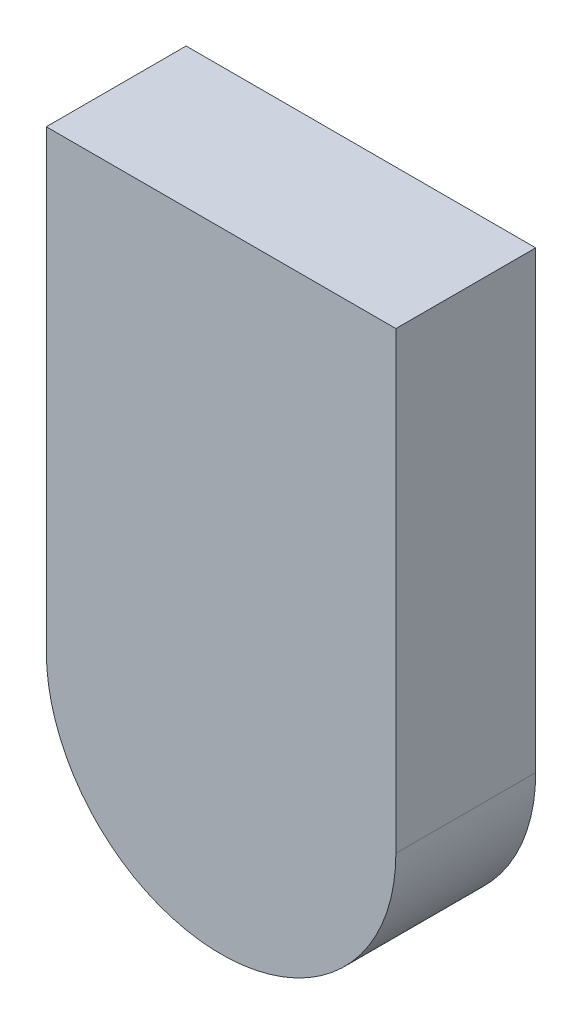
ISO-10303-21;
HEADER;
FILE_DESCRIPTION(('STEP AP214'),'2;1');
FILE_NAME('part.step','',(''),(''),'','','');
FILE_SCHEMA(('AUTOMOTIVE_DESIGN { 1 0 10303 214 1 1 1 1 }'));
ENDSEC;
DATA;
#1=APPLICATION_CONTEXT('core data for automotive mechanical design processes');
#2=APPLICATION_PROTOCOL_DEFINITION('international standard','automotive_design',2000,#1);
#3=PRODUCT_CONTEXT('',#1,'mechanical');
#4=PRODUCT('Part','Part','',(#3));
#5=PRODUCT_RELATED_PRODUCT_CATEGORY('part','',(#4));
#6=PRODUCT_DEFINITION_FORMATION('','',#4);
#7=PRODUCT_DEFINITION_CONTEXT('part definition',#1,'design');
#8=PRODUCT_DEFINITION('design','',#6,#7);
#9=PRODUCT_DEFINITION_SHAPE('','',#8);
#10=(LENGTH_UNIT() NAMED_UNIT(*) SI_UNIT(.MILLI.,.METRE.));
#11=(NAMED_UNIT(*) PLANE_ANGLE_UNIT() SI_UNIT($,.RADIAN.));
#12=(NAMED_UNIT(*) SI_UNIT($,.STERADIAN.) SOLID_ANGLE_UNIT());
#13=UNCERTAINTY_MEASURE_WITH_UNIT(LENGTH_MEASURE(1.E-05),#10,'distance_accuracy_value','');
#14=(GEOMETRIC_REPRESENTATION_CONTEXT(3) GLOBAL_UNCERTAINTY_ASSIGNED_CONTEXT((#13)) GLOBAL_UNIT_ASSIGNED_CONTEXT((#10,
#11,#12)) REPRESENTATION_CONTEXT('',''));
#15=CARTESIAN_POINT('',(0.,0.,0.));
#16=DIRECTION('',(0.,0.,1.));
#17=DIRECTION('',(1.,0.,0.));
#18=AXIS2_PLACEMENT_3D('',#15,#16,#17);
#19=CARTESIAN_POINT('',(-0.875,2.05,0.));
#20=DIRECTION('',(0.,1.,0.));
#21=DIRECTION('',(1.,0.,0.));
#22=AXIS2_PLACEMENT_3D('',#19,#20,#21);
#23=PLANE('',#22);
#24=DIRECTION('',(0.,0.,1.));
#25=VECTOR('',#24,1.);
#26=CARTESIAN_POINT('',(-0.875,2.05,0.));
#27=LINE('',#26,#25);
#28=CARTESIAN_POINT('',(-0.875,2.05,0.));
#29=VERTEX_POINT('',#28);
#30=CARTESIAN_POINT('',(-0.875,2.05,0.1));
#31=VERTEX_POINT('',#30);
#32=EDGE_CURVE('E11',#29,#31,#27,.T.);
#33=ORIENTED_EDGE('',*,*,#32,.T.);
#34=DIRECTION('',(1.,0.,0.));
#35=VECTOR('',#34,1.);
#36=CARTESIAN_POINT('',(-0.875,2.05,0.1));
#37=LINE('',#36,#35);
#38=CARTESIAN_POINT('',(-0.625,2.05,0.1));
#39=VERTEX_POINT('',#38);
#40=EDGE_CURVE('E24',#31,#39,#37,.T.);
#41=ORIENTED_EDGE('',*,*,#40,.T.);
#42=DIRECTION('',(0.,0.,1.));
#43=VECTOR('',#42,1.);
#44=CARTESIAN_POINT('',(-0.625,2.05,0.));
#45=LINE('',#44,#43);
#46=CARTESIAN_POINT('',(-0.625,2.05,0.));
#47=VERTEX_POINT('',#46);
#48=EDGE_CURVE('E85',#47,#39,#45,.T.);
#49=ORIENTED_EDGE('',*,*,#48,.F.);
#50=DIRECTION('',(1.,0.,0.));
#51=VECTOR('',#50,1.);
#52=CARTESIAN_POINT('',(-0.875,2.05,0.));
#53=LINE('',#52,#51);
#54=EDGE_CURVE('E82',#29,#47,#53,.T.);
#55=ORIENTED_EDGE('',*,*,#54,.F.);
#56=EDGE_LOOP('',(#33,#41,#49,#55));
#57=FACE_BOUND('',#56,.T.);
#58=ADVANCED_FACE('F17',(#57),#23,.T.);
#59=CARTESIAN_POINT('',(-0.625,2.05,0.));
#60=DIRECTION('',(1.,0.,0.));
#61=DIRECTION('',(0.,-1.,0.));
#62=AXIS2_PLACEMENT_3D('',#59,#60,#61);
#63=PLANE('',#62);
#64=ORIENTED_EDGE('',*,*,#48,.T.);
#65=DIRECTION('',(0.,-1.,0.));
#66=VECTOR('',#65,1.);
#67=CARTESIAN_POINT('',(-0.625,2.05,0.1));
#68=LINE('',#67,#66);
#69=CARTESIAN_POINT('',(-0.625,1.725,0.1));
#70=VERTEX_POINT('',#69);
#71=EDGE_CURVE('E80',#39,#70,#68,.T.);
#72=ORIENTED_EDGE('',*,*,#71,.T.);
#73=DIRECTION('',(0.,0.,1.));
#74=VECTOR('',#73,1.);
#75=CARTESIAN_POINT('',(-0.625,1.725,0.));
#76=LINE('',#75,#74);
#77=CARTESIAN_POINT('',(-0.625,1.725,0.));
#78=VERTEX_POINT('',#77);
#79=EDGE_CURVE('E60',#78,#70,#76,.T.);
#80=ORIENTED_EDGE('',*,*,#79,.F.);
#81=DIRECTION('',(0.,-1.,0.));
#82=VECTOR('',#81,1.);
#83=CARTESIAN_POINT('',(-0.625,2.05,0.));
#84=LINE('',#83,#82);
#85=EDGE_CURVE('E76',#47,#78,#84,.T.);
#86=ORIENTED_EDGE('',*,*,#85,.F.);
#87=EDGE_LOOP('',(#64,#72,#80,#86));
#88=FACE_BOUND('',#87,.T.);
#89=ADVANCED_FACE('F89',(#88),#63,.T.);
#90=CARTESIAN_POINT('',(-0.75,1.725,0.));
#91=DIRECTION('',(0.,0.,-1.));
#92=DIRECTION('',(1.,0.,0.));
#93=AXIS2_PLACEMENT_3D('',#90,#91,#92);
#94=CYLINDRICAL_SURFACE('',#93,0.125);
#95=CARTESIAN_POINT('',(-0.75,1.725,0.));
#96=DIRECTION('',(0.,0.,1.));
#97=DIRECTION('',(1.,0.,0.));
#98=AXIS2_PLACEMENT_3D('',#95,#96,#97);
#99=CIRCLE('',#98,0.125);
#100=CARTESIAN_POINT('',(-0.875,1.725,0.));
#101=VERTEX_POINT('',#100);
#102=EDGE_CURVE('E64',#101,#78,#99,.T.);
#103=ORIENTED_EDGE('',*,*,#102,.T.);
#104=ORIENTED_EDGE('',*,*,#79,.T.);
#105=CARTESIAN_POINT('',(-0.75,1.725,0.1));
#106=DIRECTION('',(0.,0.,1.));
#107=DIRECTION('',(1.,0.,0.));
#108=AXIS2_PLACEMENT_3D('',#105,#106,#107);
#109=CIRCLE('',#108,0.125);
#110=CARTESIAN_POINT('',(-0.875,1.725,0.1));
#111=VERTEX_POINT('',#110);
#112=EDGE_CURVE('E55',#111,#70,#109,.T.);
#113=ORIENTED_EDGE('',*,*,#112,.F.);
#114=DIRECTION('',(0.,0.,1.));
#115=VECTOR('',#114,1.);
#116=CARTESIAN_POINT('',(-0.875,1.725,0.));
#117=LINE('',#116,#115);
#118=EDGE_CURVE('E59',#101,#111,#117,.T.);
#119=ORIENTED_EDGE('',*,*,#118,.F.);
#120=EDGE_LOOP('',(#103,#104,#113,#119));
#121=FACE_BOUND('',#120,.T.);
#122=ADVANCED_FACE('F58',(#121),#94,.T.);
#123=CARTESIAN_POINT('',(-0.875,2.05,0.));
#124=DIRECTION('',(1.,0.,0.));
#125=DIRECTION('',(0.,-1.,0.));
#126=AXIS2_PLACEMENT_3D('',#123,#124,#125);
#127=PLANE('',#126);
#128=DIRECTION('',(0.,-1.,0.));
#129=VECTOR('',#128,1.);
#130=CARTESIAN_POINT('',(-0.875,2.05,0.));
#131=LINE('',#130,#129);
#132=EDGE_CURVE('E69',#29,#101,#131,.T.);
#133=ORIENTED_EDGE('',*,*,#132,.T.);
#134=ORIENTED_EDGE('',*,*,#118,.T.);
#135=DIRECTION('',(0.,-1.,0.));
#136=VECTOR('',#135,1.);
#137=CARTESIAN_POINT('',(-0.875,2.05,0.1));
#138=LINE('',#137,#136);
#139=EDGE_CURVE('E67',#31,#111,#138,.T.);
#140=ORIENTED_EDGE('',*,*,#139,.F.);
#141=ORIENTED_EDGE('',*,*,#32,.F.);
#142=EDGE_LOOP('',(#133,#134,#140,#141));
#143=FACE_BOUND('',#142,.T.);
#144=ADVANCED_FACE('F66',(#143),#127,.F.);
#145=CARTESIAN_POINT('',(-0.75,1.850342514613,0.));
#146=DIRECTION('',(0.,0.,-1.));
#147=DIRECTION('',(-1.,0.,0.));
#148=AXIS2_PLACEMENT_3D('',#145,#146,#147);
#149=PLANE('',#148);
#150=ORIENTED_EDGE('',*,*,#54,.T.);
#151=ORIENTED_EDGE('',*,*,#85,.T.);
#152=ORIENTED_EDGE('',*,*,#102,.F.);
#153=ORIENTED_EDGE('',*,*,#132,.F.);
#154=EDGE_LOOP('',(#150,#151,#152,#153));
#155=FACE_BOUND('',#154,.T.);
#156=ADVANCED_FACE('F91',(#155),#149,.T.);
#157=CARTESIAN_POINT('',(-0.75,1.850342514613,0.1));
#158=DIRECTION('',(0.,0.,-1.));
#159=DIRECTION('',(-1.,0.,0.));
#160=AXIS2_PLACEMENT_3D('',#157,#158,#159);
#161=PLANE('',#160);
#162=ORIENTED_EDGE('',*,*,#139,.T.);
#163=ORIENTED_EDGE('',*,*,#112,.T.);
#164=ORIENTED_EDGE('',*,*,#71,.F.);
#165=ORIENTED_EDGE('',*,*,#40,.F.);
#166=EDGE_LOOP('',(#162,#163,#164,#165));
#167=FACE_BOUND('',#166,.T.);
#168=ADVANCED_FACE('F71',(#167),#161,.F.);
#169=CLOSED_SHELL('',(#58,#89,#122,#144,#156,#168));
#170=MANIFOLD_SOLID_BREP('B1',#169);
#171=ADVANCED_BREP_SHAPE_REPRESENTATION('',(#18,#170),#14);
#172=SHAPE_DEFINITION_REPRESENTATION(#9,#171);
ENDSEC;
END-ISO-10303-21;
